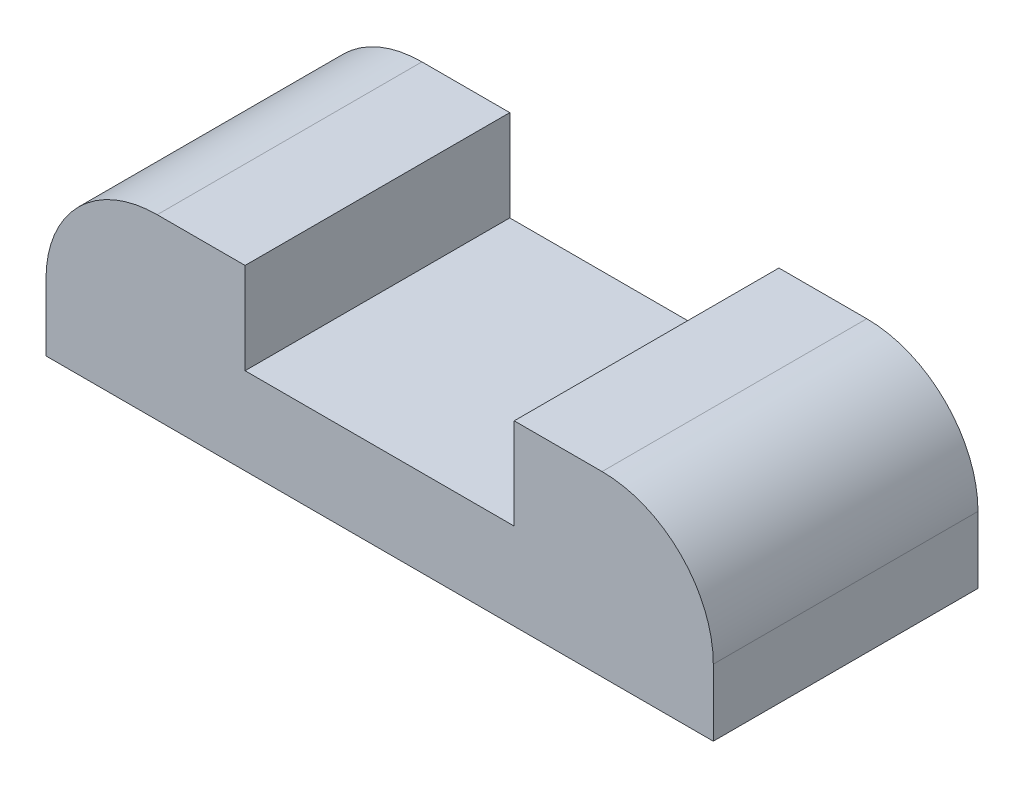
ISO-10303-21;
HEADER;
FILE_DESCRIPTION(('STEP AP214'),'2;1');
FILE_NAME('part.step','',(''),(''),'','','');
FILE_SCHEMA(('AUTOMOTIVE_DESIGN { 1 0 10303 214 1 1 1 1 }'));
ENDSEC;
DATA;
#1=APPLICATION_CONTEXT('core data for automotive mechanical design processes');
#2=APPLICATION_PROTOCOL_DEFINITION('international standard','automotive_design',2000,#1);
#3=PRODUCT_CONTEXT('',#1,'mechanical');
#4=PRODUCT('Part','Part','',(#3));
#5=PRODUCT_RELATED_PRODUCT_CATEGORY('part','',(#4));
#6=PRODUCT_DEFINITION_FORMATION('','',#4);
#7=PRODUCT_DEFINITION_CONTEXT('part definition',#1,'design');
#8=PRODUCT_DEFINITION('design','',#6,#7);
#9=PRODUCT_DEFINITION_SHAPE('','',#8);
#10=(LENGTH_UNIT() NAMED_UNIT(*) SI_UNIT(.MILLI.,.METRE.));
#11=(NAMED_UNIT(*) PLANE_ANGLE_UNIT() SI_UNIT($,.RADIAN.));
#12=(NAMED_UNIT(*) SI_UNIT($,.STERADIAN.) SOLID_ANGLE_UNIT());
#13=UNCERTAINTY_MEASURE_WITH_UNIT(LENGTH_MEASURE(1.E-05),#10,'distance_accuracy_value','');
#14=(GEOMETRIC_REPRESENTATION_CONTEXT(3) GLOBAL_UNCERTAINTY_ASSIGNED_CONTEXT((#13)) GLOBAL_UNIT_ASSIGNED_CONTEXT((#10,
#11,#12)) REPRESENTATION_CONTEXT('',''));
#15=CARTESIAN_POINT('',(0.,0.,0.));
#16=DIRECTION('',(0.,0.,1.));
#17=DIRECTION('',(1.,0.,0.));
#18=AXIS2_PLACEMENT_3D('',#15,#16,#17);
#19=CARTESIAN_POINT('',(0.,8.,0.));
#20=DIRECTION('',(0.,1.,0.));
#21=DIRECTION('',(0.,0.,1.));
#22=AXIS2_PLACEMENT_3D('',#19,#20,#21);
#23=PLANE('',#22);
#24=DIRECTION('',(-1.,0.,0.));
#25=VECTOR('',#24,1.);
#26=CARTESIAN_POINT('',(-15.,8.,-5.95));
#27=LINE('',#26,#25);
#28=CARTESIAN_POINT('',(-6.05,8.,-5.95));
#29=VERTEX_POINT('',#28);
#30=CARTESIAN_POINT('',(-10.,8.,-5.95));
#31=VERTEX_POINT('',#30);
#32=EDGE_CURVE('E169',#29,#31,#27,.T.);
#33=ORIENTED_EDGE('',*,*,#32,.T.);
#34=DIRECTION('',(0.,0.,1.));
#35=VECTOR('',#34,1.);
#36=CARTESIAN_POINT('',(-10.,8.,5.95));
#37=LINE('',#36,#35);
#38=CARTESIAN_POINT('',(-10.,8.,5.95));
#39=VERTEX_POINT('',#38);
#40=EDGE_CURVE('E201',#31,#39,#37,.T.);
#41=ORIENTED_EDGE('',*,*,#40,.T.);
#42=DIRECTION('',(1.,0.,0.));
#43=VECTOR('',#42,1.);
#44=CARTESIAN_POINT('',(-15.,8.,5.95));
#45=LINE('',#44,#43);
#46=CARTESIAN_POINT('',(-6.05,8.,5.95));
#47=VERTEX_POINT('',#46);
#48=EDGE_CURVE('E166',#39,#47,#45,.T.);
#49=ORIENTED_EDGE('',*,*,#48,.T.);
#50=DIRECTION('',(0.,0.,1.));
#51=VECTOR('',#50,1.);
#52=CARTESIAN_POINT('',(-6.05,8.,-5.95));
#53=LINE('',#52,#51);
#54=EDGE_CURVE('E122',#29,#47,#53,.T.);
#55=ORIENTED_EDGE('',*,*,#54,.F.);
#56=EDGE_LOOP('',(#33,#41,#49,#55));
#57=FACE_BOUND('',#56,.T.);
#58=ADVANCED_FACE('F39',(#57),#23,.T.);
#59=CARTESIAN_POINT('',(-15.,8.,-5.95));
#60=DIRECTION('',(1.,0.,0.));
#61=DIRECTION('',(0.,0.,-1.));
#62=AXIS2_PLACEMENT_3D('',#59,#60,#61);
#63=PLANE('',#62);
#64=DIRECTION('',(0.,-1.,0.));
#65=VECTOR('',#64,1.);
#66=CARTESIAN_POINT('',(-15.,8.,5.95));
#67=LINE('',#66,#65);
#68=CARTESIAN_POINT('',(-15.,3.,5.95));
#69=VERTEX_POINT('',#68);
#70=CARTESIAN_POINT('',(-15.,0.,5.95));
#71=VERTEX_POINT('',#70);
#72=EDGE_CURVE('E198',#69,#71,#67,.T.);
#73=ORIENTED_EDGE('',*,*,#72,.F.);
#74=DIRECTION('',(0.,0.,1.));
#75=VECTOR('',#74,1.);
#76=CARTESIAN_POINT('',(-15.,3.,-5.95));
#77=LINE('',#76,#75);
#78=CARTESIAN_POINT('',(-15.,3.,-5.95));
#79=VERTEX_POINT('',#78);
#80=EDGE_CURVE('E211',#69,#79,#77,.F.);
#81=ORIENTED_EDGE('',*,*,#80,.T.);
#82=DIRECTION('',(0.,-1.,0.));
#83=VECTOR('',#82,1.);
#84=CARTESIAN_POINT('',(-15.,8.,-5.95));
#85=LINE('',#84,#83);
#86=CARTESIAN_POINT('',(-15.,0.,-5.95));
#87=VERTEX_POINT('',#86);
#88=EDGE_CURVE('E174',#79,#87,#85,.T.);
#89=ORIENTED_EDGE('',*,*,#88,.T.);
#90=DIRECTION('',(0.,0.,1.));
#91=VECTOR('',#90,1.);
#92=CARTESIAN_POINT('',(-15.,0.,-5.95));
#93=LINE('',#92,#91);
#94=EDGE_CURVE('E159',#87,#71,#93,.T.);
#95=ORIENTED_EDGE('',*,*,#94,.T.);
#96=EDGE_LOOP('',(#73,#81,#89,#95));
#97=FACE_BOUND('',#96,.T.);
#98=ADVANCED_FACE('F242',(#97),#63,.F.);
#99=CARTESIAN_POINT('',(-15.,8.,5.95));
#100=DIRECTION('',(0.,0.,-1.));
#101=DIRECTION('',(-1.,0.,0.));
#102=AXIS2_PLACEMENT_3D('',#99,#100,#101);
#103=PLANE('',#102);
#104=ORIENTED_EDGE('',*,*,#48,.F.);
#105=CARTESIAN_POINT('',(-10.,3.,5.95));
#106=DIRECTION('',(0.,0.,-1.));
#107=DIRECTION('',(-1.,0.,0.));
#108=AXIS2_PLACEMENT_3D('',#105,#106,#107);
#109=CIRCLE('',#108,5.);
#110=EDGE_CURVE('E208',#39,#69,#109,.F.);
#111=ORIENTED_EDGE('',*,*,#110,.T.);
#112=ORIENTED_EDGE('',*,*,#72,.T.);
#113=DIRECTION('',(1.,0.,0.));
#114=VECTOR('',#113,1.);
#115=CARTESIAN_POINT('',(-15.,0.,5.95));
#116=LINE('',#115,#114);
#117=CARTESIAN_POINT('',(15.,0.,5.95));
#118=VERTEX_POINT('',#117);
#119=EDGE_CURVE('E178',#71,#118,#116,.T.);
#120=ORIENTED_EDGE('',*,*,#119,.T.);
#121=DIRECTION('',(0.,-1.,0.));
#122=VECTOR('',#121,1.);
#123=CARTESIAN_POINT('',(15.,8.,5.95));
#124=LINE('',#123,#122);
#125=CARTESIAN_POINT('',(15.,3.,5.95));
#126=VERTEX_POINT('',#125);
#127=EDGE_CURVE('E195',#126,#118,#124,.T.);
#128=ORIENTED_EDGE('',*,*,#127,.F.);
#129=CARTESIAN_POINT('',(10.,3.,5.95));
#130=DIRECTION('',(0.,0.,-1.));
#131=DIRECTION('',(-1.,0.,0.));
#132=AXIS2_PLACEMENT_3D('',#129,#130,#131);
#133=CIRCLE('',#132,5.);
#134=CARTESIAN_POINT('',(10.,8.,5.95));
#135=VERTEX_POINT('',#134);
#136=EDGE_CURVE('E205',#126,#135,#133,.F.);
#137=ORIENTED_EDGE('',*,*,#136,.T.);
#138=CARTESIAN_POINT('',(6.05,8.,5.95));
#139=VERTEX_POINT('',#138);
#140=EDGE_CURVE('E170',#139,#135,#45,.T.);
#141=ORIENTED_EDGE('',*,*,#140,.F.);
#142=DIRECTION('',(0.,1.,0.));
#143=VECTOR('',#142,1.);
#144=CARTESIAN_POINT('',(6.05,3.9,5.95));
#145=LINE('',#144,#143);
#146=CARTESIAN_POINT('',(6.05,3.9,5.95));
#147=VERTEX_POINT('',#146);
#148=EDGE_CURVE('E127',#147,#139,#145,.T.);
#149=ORIENTED_EDGE('',*,*,#148,.F.);
#150=DIRECTION('',(1.,0.,0.));
#151=VECTOR('',#150,1.);
#152=CARTESIAN_POINT('',(-6.05,3.9,5.95));
#153=LINE('',#152,#151);
#154=CARTESIAN_POINT('',(-6.05,3.9,5.95));
#155=VERTEX_POINT('',#154);
#156=EDGE_CURVE('E134',#155,#147,#153,.T.);
#157=ORIENTED_EDGE('',*,*,#156,.F.);
#158=DIRECTION('',(0.,1.,0.));
#159=VECTOR('',#158,1.);
#160=CARTESIAN_POINT('',(-6.05,3.9,5.95));
#161=LINE('',#160,#159);
#162=EDGE_CURVE('E116',#155,#47,#161,.T.);
#163=ORIENTED_EDGE('',*,*,#162,.T.);
#164=EDGE_LOOP('',(#104,#111,#112,#120,#128,#137,#141,#149,#157,#163));
#165=FACE_BOUND('',#164,.T.);
#166=ADVANCED_FACE('F141',(#165),#103,.F.);
#167=CARTESIAN_POINT('',(15.,8.,-5.95));
#168=DIRECTION('',(-1.,0.,0.));
#169=DIRECTION('',(0.,0.,1.));
#170=AXIS2_PLACEMENT_3D('',#167,#168,#169);
#171=PLANE('',#170);
#172=DIRECTION('',(0.,-1.,0.));
#173=VECTOR('',#172,1.);
#174=CARTESIAN_POINT('',(15.,8.,-5.95));
#175=LINE('',#174,#173);
#176=CARTESIAN_POINT('',(15.,3.,-5.95));
#177=VERTEX_POINT('',#176);
#178=CARTESIAN_POINT('',(15.,0.,-5.95));
#179=VERTEX_POINT('',#178);
#180=EDGE_CURVE('E192',#177,#179,#175,.T.);
#181=ORIENTED_EDGE('',*,*,#180,.F.);
#182=DIRECTION('',(0.,0.,-1.));
#183=VECTOR('',#182,1.);
#184=CARTESIAN_POINT('',(15.,3.,5.95));
#185=LINE('',#184,#183);
#186=EDGE_CURVE('E11',#177,#126,#185,.F.);
#187=ORIENTED_EDGE('',*,*,#186,.T.);
#188=ORIENTED_EDGE('',*,*,#127,.T.);
#189=DIRECTION('',(0.,0.,-1.));
#190=VECTOR('',#189,1.);
#191=CARTESIAN_POINT('',(15.,0.,-5.95));
#192=LINE('',#191,#190);
#193=EDGE_CURVE('E182',#118,#179,#192,.T.);
#194=ORIENTED_EDGE('',*,*,#193,.T.);
#195=EDGE_LOOP('',(#181,#187,#188,#194));
#196=FACE_BOUND('',#195,.T.);
#197=ADVANCED_FACE('F249',(#196),#171,.F.);
#198=CARTESIAN_POINT('',(-15.,8.,-5.95));
#199=DIRECTION('',(0.,0.,1.));
#200=DIRECTION('',(1.,0.,0.));
#201=AXIS2_PLACEMENT_3D('',#198,#199,#200);
#202=PLANE('',#201);
#203=ORIENTED_EDGE('',*,*,#88,.F.);
#204=CARTESIAN_POINT('',(-10.,3.,-5.95));
#205=DIRECTION('',(0.,0.,1.));
#206=DIRECTION('',(1.,0.,0.));
#207=AXIS2_PLACEMENT_3D('',#204,#205,#206);
#208=CIRCLE('',#207,5.);
#209=EDGE_CURVE('E216',#79,#31,#208,.F.);
#210=ORIENTED_EDGE('',*,*,#209,.T.);
#211=ORIENTED_EDGE('',*,*,#32,.F.);
#212=DIRECTION('',(0.,1.,0.));
#213=VECTOR('',#212,1.);
#214=CARTESIAN_POINT('',(-6.05,3.9,-5.95));
#215=LINE('',#214,#213);
#216=CARTESIAN_POINT('',(-6.05,3.9,-5.95));
#217=VERTEX_POINT('',#216);
#218=EDGE_CURVE('E156',#217,#29,#215,.T.);
#219=ORIENTED_EDGE('',*,*,#218,.F.);
#220=DIRECTION('',(-1.,0.,0.));
#221=VECTOR('',#220,1.);
#222=CARTESIAN_POINT('',(-6.05,3.9,-5.95));
#223=LINE('',#222,#221);
#224=CARTESIAN_POINT('',(6.05,3.9,-5.95));
#225=VERTEX_POINT('',#224);
#226=EDGE_CURVE('E128',#225,#217,#223,.T.);
#227=ORIENTED_EDGE('',*,*,#226,.F.);
#228=DIRECTION('',(0.,1.,0.));
#229=VECTOR('',#228,1.);
#230=CARTESIAN_POINT('',(6.05,3.9,-5.95));
#231=LINE('',#230,#229);
#232=CARTESIAN_POINT('',(6.05,8.,-5.95));
#233=VERTEX_POINT('',#232);
#234=EDGE_CURVE('E160',#225,#233,#231,.T.);
#235=ORIENTED_EDGE('',*,*,#234,.T.);
#236=CARTESIAN_POINT('',(10.,8.,-5.95));
#237=VERTEX_POINT('',#236);
#238=EDGE_CURVE('E171',#237,#233,#27,.T.);
#239=ORIENTED_EDGE('',*,*,#238,.F.);
#240=CARTESIAN_POINT('',(10.,3.,-5.95));
#241=DIRECTION('',(0.,0.,1.));
#242=DIRECTION('',(1.,0.,0.));
#243=AXIS2_PLACEMENT_3D('',#240,#241,#242);
#244=CIRCLE('',#243,5.);
#245=EDGE_CURVE('E55',#237,#177,#244,.F.);
#246=ORIENTED_EDGE('',*,*,#245,.T.);
#247=ORIENTED_EDGE('',*,*,#180,.T.);
#248=DIRECTION('',(-1.,0.,0.));
#249=VECTOR('',#248,1.);
#250=CARTESIAN_POINT('',(-15.,0.,-5.95));
#251=LINE('',#250,#249);
#252=EDGE_CURVE('E186',#179,#87,#251,.T.);
#253=ORIENTED_EDGE('',*,*,#252,.T.);
#254=EDGE_LOOP('',(#203,#210,#211,#219,#227,#235,#239,#246,#247,#253));
#255=FACE_BOUND('',#254,.T.);
#256=ADVANCED_FACE('F225',(#255),#202,.F.);
#257=ORIENTED_EDGE('',*,*,#140,.T.);
#258=DIRECTION('',(0.,0.,-1.));
#259=VECTOR('',#258,1.);
#260=CARTESIAN_POINT('',(10.,8.,-5.95));
#261=LINE('',#260,#259);
#262=EDGE_CURVE('E48',#135,#237,#261,.T.);
#263=ORIENTED_EDGE('',*,*,#262,.T.);
#264=ORIENTED_EDGE('',*,*,#238,.T.);
#265=DIRECTION('',(0.,0.,-1.));
#266=VECTOR('',#265,1.);
#267=CARTESIAN_POINT('',(6.05,8.,-5.95));
#268=LINE('',#267,#266);
#269=EDGE_CURVE('E139',#139,#233,#268,.T.);
#270=ORIENTED_EDGE('',*,*,#269,.F.);
#271=EDGE_LOOP('',(#257,#263,#264,#270));
#272=FACE_BOUND('',#271,.T.);
#273=ADVANCED_FACE('F221',(#272),#23,.T.);
#274=CARTESIAN_POINT('',(0.,0.,0.));
#275=DIRECTION('',(0.,1.,0.));
#276=DIRECTION('',(0.,0.,1.));
#277=AXIS2_PLACEMENT_3D('',#274,#275,#276);
#278=PLANE('',#277);
#279=ORIENTED_EDGE('',*,*,#94,.F.);
#280=ORIENTED_EDGE('',*,*,#252,.F.);
#281=ORIENTED_EDGE('',*,*,#193,.F.);
#282=ORIENTED_EDGE('',*,*,#119,.F.);
#283=EDGE_LOOP('',(#279,#280,#281,#282));
#284=FACE_BOUND('',#283,.T.);
#285=ADVANCED_FACE('F246',(#284),#278,.F.);
#286=CARTESIAN_POINT('',(-6.05,3.9,-5.95));
#287=DIRECTION('',(-1.,0.,0.));
#288=DIRECTION('',(0.,0.,1.));
#289=AXIS2_PLACEMENT_3D('',#286,#287,#288);
#290=PLANE('',#289);
#291=ORIENTED_EDGE('',*,*,#54,.T.);
#292=ORIENTED_EDGE('',*,*,#162,.F.);
#293=DIRECTION('',(0.,0.,1.));
#294=VECTOR('',#293,1.);
#295=CARTESIAN_POINT('',(-6.05,3.9,-5.95));
#296=LINE('',#295,#294);
#297=EDGE_CURVE('E119',#217,#155,#296,.T.);
#298=ORIENTED_EDGE('',*,*,#297,.F.);
#299=ORIENTED_EDGE('',*,*,#218,.T.);
#300=EDGE_LOOP('',(#291,#292,#298,#299));
#301=FACE_BOUND('',#300,.T.);
#302=ADVANCED_FACE('F118',(#301),#290,.F.);
#303=CARTESIAN_POINT('',(6.05,3.9,-5.95));
#304=DIRECTION('',(1.,0.,0.));
#305=DIRECTION('',(0.,0.,-1.));
#306=AXIS2_PLACEMENT_3D('',#303,#304,#305);
#307=PLANE('',#306);
#308=ORIENTED_EDGE('',*,*,#269,.T.);
#309=ORIENTED_EDGE('',*,*,#234,.F.);
#310=DIRECTION('',(0.,0.,-1.));
#311=VECTOR('',#310,1.);
#312=CARTESIAN_POINT('',(6.05,3.9,-5.95));
#313=LINE('',#312,#311);
#314=EDGE_CURVE('E144',#147,#225,#313,.T.);
#315=ORIENTED_EDGE('',*,*,#314,.F.);
#316=ORIENTED_EDGE('',*,*,#148,.T.);
#317=EDGE_LOOP('',(#308,#309,#315,#316));
#318=FACE_BOUND('',#317,.T.);
#319=ADVANCED_FACE('F227',(#318),#307,.F.);
#320=CARTESIAN_POINT('',(0.,3.9,0.));
#321=DIRECTION('',(0.,1.,0.));
#322=DIRECTION('',(0.,0.,1.));
#323=AXIS2_PLACEMENT_3D('',#320,#321,#322);
#324=PLANE('',#323);
#325=ORIENTED_EDGE('',*,*,#297,.T.);
#326=ORIENTED_EDGE('',*,*,#156,.T.);
#327=ORIENTED_EDGE('',*,*,#314,.T.);
#328=ORIENTED_EDGE('',*,*,#226,.T.);
#329=EDGE_LOOP('',(#325,#326,#327,#328));
#330=FACE_BOUND('',#329,.T.);
#331=ADVANCED_FACE('F132',(#330),#324,.T.);
#332=CARTESIAN_POINT('',(-10.,3.,0.));
#333=DIRECTION('',(0.,0.,-1.));
#334=DIRECTION('',(-1.,0.,0.));
#335=AXIS2_PLACEMENT_3D('',#332,#333,#334);
#336=CYLINDRICAL_SURFACE('',#335,5.);
#337=ORIENTED_EDGE('',*,*,#209,.F.);
#338=ORIENTED_EDGE('',*,*,#80,.F.);
#339=ORIENTED_EDGE('',*,*,#110,.F.);
#340=ORIENTED_EDGE('',*,*,#40,.F.);
#341=EDGE_LOOP('',(#337,#338,#339,#340));
#342=FACE_BOUND('',#341,.T.);
#343=ADVANCED_FACE('F237',(#342),#336,.T.);
#344=CARTESIAN_POINT('',(10.,3.,0.));
#345=DIRECTION('',(0.,0.,1.));
#346=DIRECTION('',(1.,0.,0.));
#347=AXIS2_PLACEMENT_3D('',#344,#345,#346);
#348=CYLINDRICAL_SURFACE('',#347,5.);
#349=ORIENTED_EDGE('',*,*,#136,.F.);
#350=ORIENTED_EDGE('',*,*,#186,.F.);
#351=ORIENTED_EDGE('',*,*,#245,.F.);
#352=ORIENTED_EDGE('',*,*,#262,.F.);
#353=EDGE_LOOP('',(#349,#350,#351,#352));
#354=FACE_BOUND('',#353,.T.);
#355=ADVANCED_FACE('F41',(#354),#348,.T.);
#356=CLOSED_SHELL('',(#58,#98,#166,#197,#256,#273,#285,#302,#319,#331,#343,#355));
#357=MANIFOLD_SOLID_BREP('B2',#356);
#358=ADVANCED_BREP_SHAPE_REPRESENTATION('',(#18,#357),#14);
#359=SHAPE_DEFINITION_REPRESENTATION(#9,#358);
ENDSEC;
END-ISO-10303-21;
